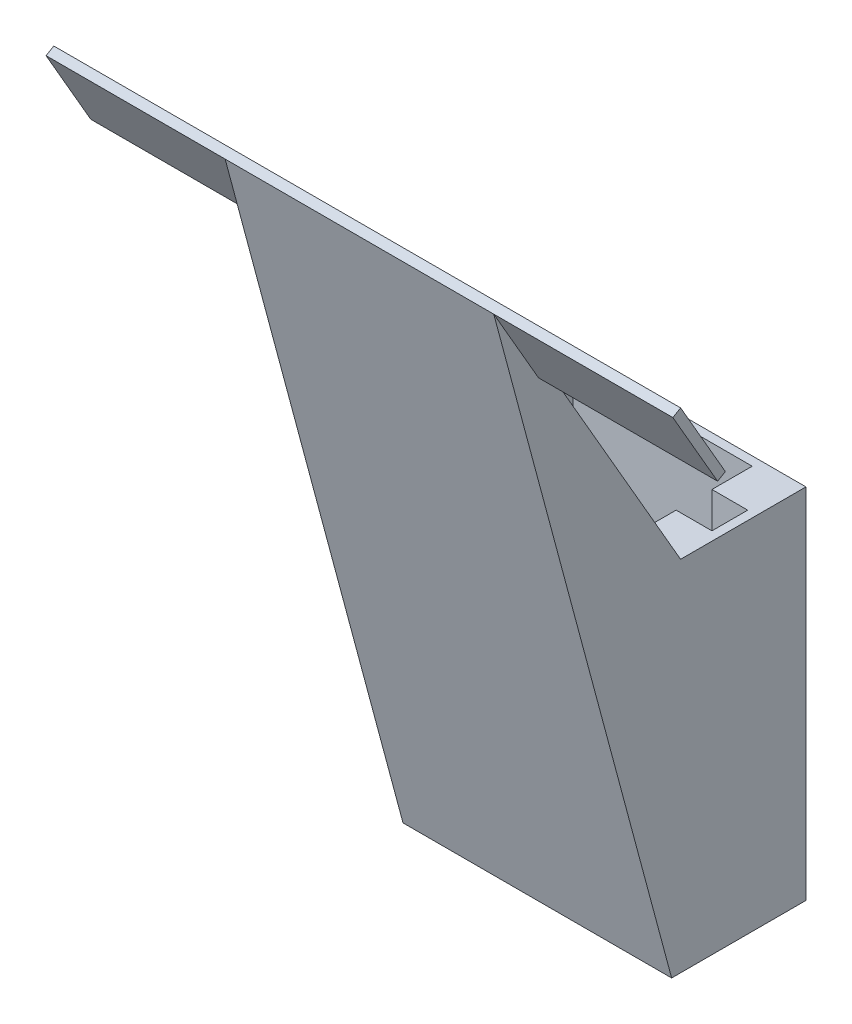
ISO-10303-21;
HEADER;
FILE_DESCRIPTION(('STEP AP214'),'2;1');
FILE_NAME('part.step','',(''),(''),'','','');
FILE_SCHEMA(('AUTOMOTIVE_DESIGN { 1 0 10303 214 1 1 1 1 }'));
ENDSEC;
DATA;
#1=APPLICATION_CONTEXT('core data for automotive mechanical design processes');
#2=APPLICATION_PROTOCOL_DEFINITION('international standard','automotive_design',2000,#1);
#3=PRODUCT_CONTEXT('',#1,'mechanical');
#4=PRODUCT('Part','Part','',(#3));
#5=PRODUCT_RELATED_PRODUCT_CATEGORY('part','',(#4));
#6=PRODUCT_DEFINITION_FORMATION('','',#4);
#7=PRODUCT_DEFINITION_CONTEXT('part definition',#1,'design');
#8=PRODUCT_DEFINITION('design','',#6,#7);
#9=PRODUCT_DEFINITION_SHAPE('','',#8);
#10=(LENGTH_UNIT() NAMED_UNIT(*) SI_UNIT(.MILLI.,.METRE.));
#11=(NAMED_UNIT(*) PLANE_ANGLE_UNIT() SI_UNIT($,.RADIAN.));
#12=(NAMED_UNIT(*) SI_UNIT($,.STERADIAN.) SOLID_ANGLE_UNIT());
#13=UNCERTAINTY_MEASURE_WITH_UNIT(LENGTH_MEASURE(1.E-05),#10,'distance_accuracy_value','');
#14=(GEOMETRIC_REPRESENTATION_CONTEXT(3) GLOBAL_UNCERTAINTY_ASSIGNED_CONTEXT((#13)) GLOBAL_UNIT_ASSIGNED_CONTEXT((#10,
#11,#12)) REPRESENTATION_CONTEXT('',''));
#15=CARTESIAN_POINT('',(0.,0.,0.));
#16=DIRECTION('',(0.,0.,1.));
#17=DIRECTION('',(1.,0.,0.));
#18=AXIS2_PLACEMENT_3D('',#15,#16,#17);
#19=CARTESIAN_POINT('',(-7.5,20.,3.75));
#20=DIRECTION('',(1.,0.,0.));
#21=DIRECTION('',(0.,0.,-1.));
#22=AXIS2_PLACEMENT_3D('',#19,#20,#21);
#23=PLANE('',#22);
#24=DIRECTION('',(0.,0.866025403784439,0.5));
#25=VECTOR('',#24,1.);
#26=CARTESIAN_POINT('',(-7.5,37.0705080756888,13.6830127018922));
#27=LINE('',#26,#25);
#28=CARTESIAN_POINT('',(-7.5,32.7403810567666,11.1830127018922));
#29=VERTEX_POINT('',#28);
#30=CARTESIAN_POINT('',(-7.5,37.0705080756888,13.6830127018922));
#31=VERTEX_POINT('',#30);
#32=EDGE_CURVE('E259',#29,#31,#27,.T.);
#33=ORIENTED_EDGE('',*,*,#32,.F.);
#34=DIRECTION('',(0.,-0.499999999999985,0.866025403784447));
#35=VECTOR('',#34,1.);
#36=CARTESIAN_POINT('',(-7.5,32.9903810567666,10.75));
#37=LINE('',#36,#35);
#38=CARTESIAN_POINT('',(-7.5,32.9903810567666,10.75));
#39=VERTEX_POINT('',#38);
#40=EDGE_CURVE('E79',#39,#29,#37,.T.);
#41=ORIENTED_EDGE('',*,*,#40,.F.);
#42=DIRECTION('',(0.,-0.866025403784438,-0.500000000000001));
#43=VECTOR('',#42,1.);
#44=CARTESIAN_POINT('',(-7.5,20.,3.25));
#45=LINE('',#44,#43);
#46=CARTESIAN_POINT('',(-7.5,20.,3.25));
#47=VERTEX_POINT('',#46);
#48=EDGE_CURVE('E444',#39,#47,#45,.T.);
#49=ORIENTED_EDGE('',*,*,#48,.T.);
#50=DIRECTION('',(0.,0.,1.));
#51=VECTOR('',#50,1.);
#52=CARTESIAN_POINT('',(-7.5,20.,3.75));
#53=LINE('',#52,#51);
#54=CARTESIAN_POINT('',(-7.5,20.,-3.75));
#55=VERTEX_POINT('',#54);
#56=EDGE_CURVE('E288',#55,#47,#53,.T.);
#57=ORIENTED_EDGE('',*,*,#56,.F.);
#58=DIRECTION('',(0.,-1.,0.));
#59=VECTOR('',#58,1.);
#60=CARTESIAN_POINT('',(-7.5,20.,-3.75));
#61=LINE('',#60,#59);
#62=CARTESIAN_POINT('',(-7.5,0.,-3.75));
#63=VERTEX_POINT('',#62);
#64=EDGE_CURVE('E58',#55,#63,#61,.T.);
#65=ORIENTED_EDGE('',*,*,#64,.T.);
#66=DIRECTION('',(0.,0.,1.));
#67=VECTOR('',#66,1.);
#68=CARTESIAN_POINT('',(-7.5,0.,3.75));
#69=LINE('',#68,#67);
#70=CARTESIAN_POINT('',(-7.5,0.,3.75));
#71=VERTEX_POINT('',#70);
#72=EDGE_CURVE('E305',#63,#71,#69,.T.);
#73=ORIENTED_EDGE('',*,*,#72,.T.);
#74=DIRECTION('',(0.,0.965925826289068,0.258819045102521));
#75=VECTOR('',#74,1.);
#76=CARTESIAN_POINT('',(-7.5,37.0705080756888,13.6830127018922));
#77=LINE('',#76,#75);
#78=EDGE_CURVE('E441',#71,#31,#77,.T.);
#79=ORIENTED_EDGE('',*,*,#78,.T.);
#80=EDGE_LOOP('',(#33,#41,#49,#57,#65,#73,#79));
#81=FACE_BOUND('',#80,.T.);
#82=ADVANCED_FACE('F48',(#81),#23,.F.);
#83=CARTESIAN_POINT('',(0.,20.,0.));
#84=DIRECTION('',(0.,1.,0.));
#85=DIRECTION('',(0.,0.,1.));
#86=AXIS2_PLACEMENT_3D('',#83,#84,#85);
#87=PLANE('',#86);
#88=DIRECTION('',(-1.,0.,0.));
#89=VECTOR('',#88,1.);
#90=CARTESIAN_POINT('',(7.5,20.,3.25));
#91=LINE('',#90,#89);
#92=CARTESIAN_POINT('',(7.5,20.,3.25));
#93=VERTEX_POINT('',#92);
#94=CARTESIAN_POINT('',(5.,20.,3.25));
#95=VERTEX_POINT('',#94);
#96=EDGE_CURVE('E324',#93,#95,#91,.T.);
#97=ORIENTED_EDGE('',*,*,#96,.F.);
#98=DIRECTION('',(0.,0.,-1.));
#99=VECTOR('',#98,1.);
#100=CARTESIAN_POINT('',(7.5,20.,3.75));
#101=LINE('',#100,#99);
#102=CARTESIAN_POINT('',(7.5,20.,-3.75));
#103=VERTEX_POINT('',#102);
#104=EDGE_CURVE('E293',#93,#103,#101,.T.);
#105=ORIENTED_EDGE('',*,*,#104,.T.);
#106=DIRECTION('',(-1.,0.,0.));
#107=VECTOR('',#106,1.);
#108=CARTESIAN_POINT('',(7.5,20.,-3.75));
#109=LINE('',#108,#107);
#110=EDGE_CURVE('E301',#103,#55,#109,.T.);
#111=ORIENTED_EDGE('',*,*,#110,.T.);
#112=ORIENTED_EDGE('',*,*,#56,.T.);
#113=CARTESIAN_POINT('',(-5.,20.,3.25));
#114=VERTEX_POINT('',#113);
#115=EDGE_CURVE('E423',#114,#47,#91,.T.);
#116=ORIENTED_EDGE('',*,*,#115,.F.);
#117=DIRECTION('',(0.,0.,1.));
#118=VECTOR('',#117,1.);
#119=CARTESIAN_POINT('',(-5.,20.,3.25));
#120=LINE('',#119,#118);
#121=CARTESIAN_POINT('',(-5.,20.,1.));
#122=VERTEX_POINT('',#121);
#123=EDGE_CURVE('E581',#122,#114,#120,.T.);
#124=ORIENTED_EDGE('',*,*,#123,.F.);
#125=DIRECTION('',(1.,0.,0.));
#126=VECTOR('',#125,1.);
#127=CARTESIAN_POINT('',(-5.,20.,1.));
#128=LINE('',#127,#126);
#129=CARTESIAN_POINT('',(-7.,20.,1.));
#130=VERTEX_POINT('',#129);
#131=EDGE_CURVE('E579',#130,#122,#128,.T.);
#132=ORIENTED_EDGE('',*,*,#131,.F.);
#133=DIRECTION('',(0.,0.,1.));
#134=VECTOR('',#133,1.);
#135=CARTESIAN_POINT('',(-7.,20.,1.));
#136=LINE('',#135,#134);
#137=CARTESIAN_POINT('',(-7.,20.,-1.));
#138=VERTEX_POINT('',#137);
#139=EDGE_CURVE('E351',#138,#130,#136,.T.);
#140=ORIENTED_EDGE('',*,*,#139,.F.);
#141=DIRECTION('',(-1.,0.,0.));
#142=VECTOR('',#141,1.);
#143=CARTESIAN_POINT('',(-5.,20.,-1.));
#144=LINE('',#143,#142);
#145=CARTESIAN_POINT('',(-5.,20.,-1.));
#146=VERTEX_POINT('',#145);
#147=EDGE_CURVE('E344',#146,#138,#144,.T.);
#148=ORIENTED_EDGE('',*,*,#147,.F.);
#149=DIRECTION('',(0.,0.,1.));
#150=VECTOR('',#149,1.);
#151=CARTESIAN_POINT('',(-5.,20.,-1.));
#152=LINE('',#151,#150);
#153=CARTESIAN_POINT('',(-5.,20.,-3.25));
#154=VERTEX_POINT('',#153);
#155=EDGE_CURVE('E340',#154,#146,#152,.T.);
#156=ORIENTED_EDGE('',*,*,#155,.F.);
#157=DIRECTION('',(-1.,0.,0.));
#158=VECTOR('',#157,1.);
#159=CARTESIAN_POINT('',(5.,20.,-3.25));
#160=LINE('',#159,#158);
#161=CARTESIAN_POINT('',(5.,20.,-3.25));
#162=VERTEX_POINT('',#161);
#163=EDGE_CURVE('E345',#162,#154,#160,.T.);
#164=ORIENTED_EDGE('',*,*,#163,.F.);
#165=DIRECTION('',(0.,0.,-1.));
#166=VECTOR('',#165,1.);
#167=CARTESIAN_POINT('',(5.,20.,-1.));
#168=LINE('',#167,#166);
#169=CARTESIAN_POINT('',(5.,20.,-1.));
#170=VERTEX_POINT('',#169);
#171=EDGE_CURVE('E325',#170,#162,#168,.T.);
#172=ORIENTED_EDGE('',*,*,#171,.F.);
#173=DIRECTION('',(-1.,0.,0.));
#174=VECTOR('',#173,1.);
#175=CARTESIAN_POINT('',(7.,20.,-1.));
#176=LINE('',#175,#174);
#177=CARTESIAN_POINT('',(7.,20.,-1.));
#178=VERTEX_POINT('',#177);
#179=EDGE_CURVE('E596',#178,#170,#176,.T.);
#180=ORIENTED_EDGE('',*,*,#179,.F.);
#181=DIRECTION('',(0.,0.,-1.));
#182=VECTOR('',#181,1.);
#183=CARTESIAN_POINT('',(7.,20.,0.999999999999999));
#184=LINE('',#183,#182);
#185=CARTESIAN_POINT('',(7.,20.,0.999999999999999));
#186=VERTEX_POINT('',#185);
#187=EDGE_CURVE('E593',#186,#178,#184,.T.);
#188=ORIENTED_EDGE('',*,*,#187,.F.);
#189=DIRECTION('',(1.,0.,0.));
#190=VECTOR('',#189,1.);
#191=CARTESIAN_POINT('',(7.,20.,0.999999999999999));
#192=LINE('',#191,#190);
#193=CARTESIAN_POINT('',(5.,20.,0.999999999999999));
#194=VERTEX_POINT('',#193);
#195=EDGE_CURVE('E590',#194,#186,#192,.T.);
#196=ORIENTED_EDGE('',*,*,#195,.F.);
#197=DIRECTION('',(0.,0.,-1.));
#198=VECTOR('',#197,1.);
#199=CARTESIAN_POINT('',(5.,20.,3.25));
#200=LINE('',#199,#198);
#201=EDGE_CURVE('E587',#95,#194,#200,.T.);
#202=ORIENTED_EDGE('',*,*,#201,.F.);
#203=EDGE_LOOP('',(#97,#105,#111,#112,#116,#124,#132,#140,#148,#156,#164,#172,#180,#188,#196,#202));
#204=FACE_BOUND('',#203,.T.);
#205=ADVANCED_FACE('F516',(#204),#87,.T.);
#206=CARTESIAN_POINT('',(0.,0.,0.));
#207=DIRECTION('',(0.,1.,0.));
#208=DIRECTION('',(0.,0.,1.));
#209=AXIS2_PLACEMENT_3D('',#206,#207,#208);
#210=PLANE('',#209);
#211=ORIENTED_EDGE('',*,*,#72,.F.);
#212=DIRECTION('',(-1.,0.,0.));
#213=VECTOR('',#212,1.);
#214=CARTESIAN_POINT('',(7.5,0.,-3.75));
#215=LINE('',#214,#213);
#216=CARTESIAN_POINT('',(7.5,0.,-3.75));
#217=VERTEX_POINT('',#216);
#218=EDGE_CURVE('E294',#217,#63,#215,.T.);
#219=ORIENTED_EDGE('',*,*,#218,.F.);
#220=DIRECTION('',(0.,0.,-1.));
#221=VECTOR('',#220,1.);
#222=CARTESIAN_POINT('',(7.5,0.,3.75));
#223=LINE('',#222,#221);
#224=CARTESIAN_POINT('',(7.5,0.,3.75));
#225=VERTEX_POINT('',#224);
#226=EDGE_CURVE('E383',#225,#217,#223,.T.);
#227=ORIENTED_EDGE('',*,*,#226,.F.);
#228=DIRECTION('',(1.,0.,0.));
#229=VECTOR('',#228,1.);
#230=CARTESIAN_POINT('',(7.5,0.,3.75));
#231=LINE('',#230,#229);
#232=EDGE_CURVE('E378',#71,#225,#231,.T.);
#233=ORIENTED_EDGE('',*,*,#232,.F.);
#234=EDGE_LOOP('',(#211,#219,#227,#233));
#235=FACE_BOUND('',#234,.T.);
#236=DIRECTION('',(-1.,0.,0.));
#237=VECTOR('',#236,1.);
#238=CARTESIAN_POINT('',(5.,0.,-3.25));
#239=LINE('',#238,#237);
#240=CARTESIAN_POINT('',(5.,0.,-3.25));
#241=VERTEX_POINT('',#240);
#242=CARTESIAN_POINT('',(-5.,0.,-3.25));
#243=VERTEX_POINT('',#242);
#244=EDGE_CURVE('E317',#241,#243,#239,.T.);
#245=ORIENTED_EDGE('',*,*,#244,.T.);
#246=DIRECTION('',(0.,0.,1.));
#247=VECTOR('',#246,1.);
#248=CARTESIAN_POINT('',(-5.,0.,-1.));
#249=LINE('',#248,#247);
#250=CARTESIAN_POINT('',(-5.,0.,-1.));
#251=VERTEX_POINT('',#250);
#252=EDGE_CURVE('E323',#243,#251,#249,.T.);
#253=ORIENTED_EDGE('',*,*,#252,.T.);
#254=DIRECTION('',(-1.,0.,0.));
#255=VECTOR('',#254,1.);
#256=CARTESIAN_POINT('',(-5.,0.,-1.));
#257=LINE('',#256,#255);
#258=CARTESIAN_POINT('',(-7.,0.,-1.));
#259=VERTEX_POINT('',#258);
#260=EDGE_CURVE('E332',#251,#259,#257,.T.);
#261=ORIENTED_EDGE('',*,*,#260,.T.);
#262=DIRECTION('',(0.,0.,1.));
#263=VECTOR('',#262,1.);
#264=CARTESIAN_POINT('',(-7.,0.,1.));
#265=LINE('',#264,#263);
#266=CARTESIAN_POINT('',(-7.,0.,1.));
#267=VERTEX_POINT('',#266);
#268=EDGE_CURVE('E542',#259,#267,#265,.T.);
#269=ORIENTED_EDGE('',*,*,#268,.T.);
#270=DIRECTION('',(1.,0.,0.));
#271=VECTOR('',#270,1.);
#272=CARTESIAN_POINT('',(-5.,0.,1.));
#273=LINE('',#272,#271);
#274=CARTESIAN_POINT('',(-5.,0.,1.));
#275=VERTEX_POINT('',#274);
#276=EDGE_CURVE('E545',#267,#275,#273,.T.);
#277=ORIENTED_EDGE('',*,*,#276,.T.);
#278=DIRECTION('',(0.,0.,1.));
#279=VECTOR('',#278,1.);
#280=CARTESIAN_POINT('',(-5.,0.,3.25));
#281=LINE('',#280,#279);
#282=CARTESIAN_POINT('',(-5.,0.,3.25));
#283=VERTEX_POINT('',#282);
#284=EDGE_CURVE('E548',#275,#283,#281,.T.);
#285=ORIENTED_EDGE('',*,*,#284,.T.);
#286=DIRECTION('',(1.,0.,0.));
#287=VECTOR('',#286,1.);
#288=CARTESIAN_POINT('',(5.,0.,3.25));
#289=LINE('',#288,#287);
#290=CARTESIAN_POINT('',(5.,0.,3.25));
#291=VERTEX_POINT('',#290);
#292=EDGE_CURVE('E552',#283,#291,#289,.T.);
#293=ORIENTED_EDGE('',*,*,#292,.T.);
#294=DIRECTION('',(0.,0.,-1.));
#295=VECTOR('',#294,1.);
#296=CARTESIAN_POINT('',(5.,0.,3.25));
#297=LINE('',#296,#295);
#298=CARTESIAN_POINT('',(5.,0.,0.999999999999999));
#299=VERTEX_POINT('',#298);
#300=EDGE_CURVE('E556',#291,#299,#297,.T.);
#301=ORIENTED_EDGE('',*,*,#300,.T.);
#302=DIRECTION('',(1.,0.,0.));
#303=VECTOR('',#302,1.);
#304=CARTESIAN_POINT('',(7.,0.,0.999999999999999));
#305=LINE('',#304,#303);
#306=CARTESIAN_POINT('',(7.,0.,0.999999999999999));
#307=VERTEX_POINT('',#306);
#308=EDGE_CURVE('E560',#299,#307,#305,.T.);
#309=ORIENTED_EDGE('',*,*,#308,.T.);
#310=DIRECTION('',(0.,0.,-1.));
#311=VECTOR('',#310,1.);
#312=CARTESIAN_POINT('',(7.,0.,0.999999999999999));
#313=LINE('',#312,#311);
#314=CARTESIAN_POINT('',(7.,0.,-1.));
#315=VERTEX_POINT('',#314);
#316=EDGE_CURVE('E564',#307,#315,#313,.T.);
#317=ORIENTED_EDGE('',*,*,#316,.T.);
#318=DIRECTION('',(-1.,0.,0.));
#319=VECTOR('',#318,1.);
#320=CARTESIAN_POINT('',(7.,0.,-1.));
#321=LINE('',#320,#319);
#322=CARTESIAN_POINT('',(5.,0.,-1.));
#323=VERTEX_POINT('',#322);
#324=EDGE_CURVE('E568',#315,#323,#321,.T.);
#325=ORIENTED_EDGE('',*,*,#324,.T.);
#326=DIRECTION('',(0.,0.,-1.));
#327=VECTOR('',#326,1.);
#328=CARTESIAN_POINT('',(5.,0.,-1.));
#329=LINE('',#328,#327);
#330=EDGE_CURVE('E572',#323,#241,#329,.T.);
#331=ORIENTED_EDGE('',*,*,#330,.T.);
#332=EDGE_LOOP('',(#245,#253,#261,#269,#277,#285,#293,#301,#309,#317,#325,#331));
#333=FACE_BOUND('',#332,.T.);
#334=ADVANCED_FACE('F531',(#235,#333),#210,.F.);
#335=CARTESIAN_POINT('',(7.5,20.,3.75));
#336=DIRECTION('',(-1.,0.,0.));
#337=DIRECTION('',(0.,0.,1.));
#338=AXIS2_PLACEMENT_3D('',#335,#336,#337);
#339=PLANE('',#338);
#340=DIRECTION('',(0.,-0.499999999999985,0.866025403784447));
#341=VECTOR('',#340,1.);
#342=CARTESIAN_POINT('',(7.5,32.9903810567666,10.75));
#343=LINE('',#342,#341);
#344=CARTESIAN_POINT('',(7.5,32.9903810567666,10.75));
#345=VERTEX_POINT('',#344);
#346=CARTESIAN_POINT('',(7.5,32.7403810567666,11.1830127018922));
#347=VERTEX_POINT('',#346);
#348=EDGE_CURVE('E271',#345,#347,#343,.T.);
#349=ORIENTED_EDGE('',*,*,#348,.T.);
#350=DIRECTION('',(0.,0.866025403784439,0.5));
#351=VECTOR('',#350,1.);
#352=CARTESIAN_POINT('',(7.5,37.0705080756888,13.6830127018922));
#353=LINE('',#352,#351);
#354=CARTESIAN_POINT('',(7.5,37.0705080756888,13.6830127018922));
#355=VERTEX_POINT('',#354);
#356=EDGE_CURVE('E68',#347,#355,#353,.T.);
#357=ORIENTED_EDGE('',*,*,#356,.T.);
#358=DIRECTION('',(0.,0.965925826289068,0.258819045102521));
#359=VECTOR('',#358,1.);
#360=CARTESIAN_POINT('',(7.5,37.0705080756888,13.6830127018922));
#361=LINE('',#360,#359);
#362=EDGE_CURVE('E438',#225,#355,#361,.T.);
#363=ORIENTED_EDGE('',*,*,#362,.F.);
#364=ORIENTED_EDGE('',*,*,#226,.T.);
#365=DIRECTION('',(0.,-1.,0.));
#366=VECTOR('',#365,1.);
#367=CARTESIAN_POINT('',(7.5,20.,-3.75));
#368=LINE('',#367,#366);
#369=EDGE_CURVE('E12',#103,#217,#368,.T.);
#370=ORIENTED_EDGE('',*,*,#369,.F.);
#371=ORIENTED_EDGE('',*,*,#104,.F.);
#372=DIRECTION('',(0.,-0.866025403784438,-0.500000000000001));
#373=VECTOR('',#372,1.);
#374=CARTESIAN_POINT('',(7.5,20.,3.25));
#375=LINE('',#374,#373);
#376=EDGE_CURVE('E419',#345,#93,#375,.T.);
#377=ORIENTED_EDGE('',*,*,#376,.F.);
#378=EDGE_LOOP('',(#349,#357,#363,#364,#370,#371,#377));
#379=FACE_BOUND('',#378,.T.);
#380=ADVANCED_FACE('F534',(#379),#339,.F.);
#381=CARTESIAN_POINT('',(7.5,20.,-3.75));
#382=DIRECTION('',(0.,0.,1.));
#383=DIRECTION('',(1.,0.,0.));
#384=AXIS2_PLACEMENT_3D('',#381,#382,#383);
#385=PLANE('',#384);
#386=ORIENTED_EDGE('',*,*,#218,.T.);
#387=ORIENTED_EDGE('',*,*,#64,.F.);
#388=ORIENTED_EDGE('',*,*,#110,.F.);
#389=ORIENTED_EDGE('',*,*,#369,.T.);
#390=EDGE_LOOP('',(#386,#387,#388,#389));
#391=FACE_BOUND('',#390,.T.);
#392=ADVANCED_FACE('F523',(#391),#385,.F.);
#393=CARTESIAN_POINT('',(5.,20.,-3.25));
#394=DIRECTION('',(0.,0.,1.));
#395=DIRECTION('',(1.,0.,0.));
#396=AXIS2_PLACEMENT_3D('',#393,#394,#395);
#397=PLANE('',#396);
#398=ORIENTED_EDGE('',*,*,#244,.F.);
#399=DIRECTION('',(0.,-1.,0.));
#400=VECTOR('',#399,1.);
#401=CARTESIAN_POINT('',(5.,20.,-3.25));
#402=LINE('',#401,#400);
#403=EDGE_CURVE('E601',#162,#241,#402,.T.);
#404=ORIENTED_EDGE('',*,*,#403,.F.);
#405=ORIENTED_EDGE('',*,*,#163,.T.);
#406=DIRECTION('',(0.,-1.,0.));
#407=VECTOR('',#406,1.);
#408=CARTESIAN_POINT('',(-5.,20.,-3.25));
#409=LINE('',#408,#407);
#410=EDGE_CURVE('E295',#154,#243,#409,.T.);
#411=ORIENTED_EDGE('',*,*,#410,.T.);
#412=EDGE_LOOP('',(#398,#404,#405,#411));
#413=FACE_BOUND('',#412,.T.);
#414=ADVANCED_FACE('F672',(#413),#397,.T.);
#415=CARTESIAN_POINT('',(-5.,20.,-1.));
#416=DIRECTION('',(1.,0.,0.));
#417=DIRECTION('',(0.,0.,-1.));
#418=AXIS2_PLACEMENT_3D('',#415,#416,#417);
#419=PLANE('',#418);
#420=ORIENTED_EDGE('',*,*,#252,.F.);
#421=ORIENTED_EDGE('',*,*,#410,.F.);
#422=ORIENTED_EDGE('',*,*,#155,.T.);
#423=DIRECTION('',(0.,-1.,0.));
#424=VECTOR('',#423,1.);
#425=CARTESIAN_POINT('',(-5.,20.,-1.));
#426=LINE('',#425,#424);
#427=EDGE_CURVE('E363',#146,#251,#426,.T.);
#428=ORIENTED_EDGE('',*,*,#427,.T.);
#429=EDGE_LOOP('',(#420,#421,#422,#428));
#430=FACE_BOUND('',#429,.T.);
#431=ADVANCED_FACE('F674',(#430),#419,.T.);
#432=CARTESIAN_POINT('',(-5.,20.,-1.));
#433=DIRECTION('',(0.,0.,1.));
#434=DIRECTION('',(1.,0.,0.));
#435=AXIS2_PLACEMENT_3D('',#432,#433,#434);
#436=PLANE('',#435);
#437=ORIENTED_EDGE('',*,*,#260,.F.);
#438=ORIENTED_EDGE('',*,*,#427,.F.);
#439=ORIENTED_EDGE('',*,*,#147,.T.);
#440=DIRECTION('',(0.,-1.,0.));
#441=VECTOR('',#440,1.);
#442=CARTESIAN_POINT('',(-7.,20.,-1.));
#443=LINE('',#442,#441);
#444=EDGE_CURVE('E359',#138,#259,#443,.T.);
#445=ORIENTED_EDGE('',*,*,#444,.T.);
#446=EDGE_LOOP('',(#437,#438,#439,#445));
#447=FACE_BOUND('',#446,.T.);
#448=ADVANCED_FACE('F638',(#447),#436,.T.);
#449=CARTESIAN_POINT('',(-7.,20.,1.));
#450=DIRECTION('',(1.,0.,0.));
#451=DIRECTION('',(0.,0.,-1.));
#452=AXIS2_PLACEMENT_3D('',#449,#450,#451);
#453=PLANE('',#452);
#454=ORIENTED_EDGE('',*,*,#268,.F.);
#455=ORIENTED_EDGE('',*,*,#444,.F.);
#456=ORIENTED_EDGE('',*,*,#139,.T.);
#457=DIRECTION('',(0.,-1.,0.));
#458=VECTOR('',#457,1.);
#459=CARTESIAN_POINT('',(-7.,20.,1.));
#460=LINE('',#459,#458);
#461=EDGE_CURVE('E364',#130,#267,#460,.T.);
#462=ORIENTED_EDGE('',*,*,#461,.T.);
#463=EDGE_LOOP('',(#454,#455,#456,#462));
#464=FACE_BOUND('',#463,.T.);
#465=ADVANCED_FACE('F629',(#464),#453,.T.);
#466=CARTESIAN_POINT('',(-5.,20.,1.));
#467=DIRECTION('',(0.,0.,-1.));
#468=DIRECTION('',(-1.,0.,0.));
#469=AXIS2_PLACEMENT_3D('',#466,#467,#468);
#470=PLANE('',#469);
#471=ORIENTED_EDGE('',*,*,#276,.F.);
#472=ORIENTED_EDGE('',*,*,#461,.F.);
#473=ORIENTED_EDGE('',*,*,#131,.T.);
#474=DIRECTION('',(0.,-1.,0.));
#475=VECTOR('',#474,1.);
#476=CARTESIAN_POINT('',(-5.,20.,1.));
#477=LINE('',#476,#475);
#478=EDGE_CURVE('E622',#122,#275,#477,.T.);
#479=ORIENTED_EDGE('',*,*,#478,.T.);
#480=EDGE_LOOP('',(#471,#472,#473,#479));
#481=FACE_BOUND('',#480,.T.);
#482=ADVANCED_FACE('F634',(#481),#470,.T.);
#483=CARTESIAN_POINT('',(-5.,20.,3.25));
#484=DIRECTION('',(1.,0.,0.));
#485=DIRECTION('',(0.,0.,-1.));
#486=AXIS2_PLACEMENT_3D('',#483,#484,#485);
#487=PLANE('',#486);
#488=ORIENTED_EDGE('',*,*,#284,.F.);
#489=ORIENTED_EDGE('',*,*,#478,.F.);
#490=ORIENTED_EDGE('',*,*,#123,.T.);
#491=DIRECTION('',(0.,-1.,0.));
#492=VECTOR('',#491,1.);
#493=CARTESIAN_POINT('',(-5.,20.,3.25));
#494=LINE('',#493,#492);
#495=EDGE_CURVE('E619',#114,#283,#494,.T.);
#496=ORIENTED_EDGE('',*,*,#495,.T.);
#497=EDGE_LOOP('',(#488,#489,#490,#496));
#498=FACE_BOUND('',#497,.T.);
#499=ADVANCED_FACE('F642',(#498),#487,.T.);
#500=CARTESIAN_POINT('',(5.,20.,3.25));
#501=DIRECTION('',(0.,0.,-1.));
#502=DIRECTION('',(-1.,0.,0.));
#503=AXIS2_PLACEMENT_3D('',#500,#501,#502);
#504=PLANE('',#503);
#505=ORIENTED_EDGE('',*,*,#292,.F.);
#506=ORIENTED_EDGE('',*,*,#495,.F.);
#507=DIRECTION('',(1.,0.,0.));
#508=VECTOR('',#507,1.);
#509=CARTESIAN_POINT('',(5.,20.,3.25));
#510=LINE('',#509,#508);
#511=EDGE_CURVE('E583',#114,#95,#510,.T.);
#512=ORIENTED_EDGE('',*,*,#511,.T.);
#513=DIRECTION('',(0.,-1.,0.));
#514=VECTOR('',#513,1.);
#515=CARTESIAN_POINT('',(5.,20.,3.25));
#516=LINE('',#515,#514);
#517=EDGE_CURVE('E616',#95,#291,#516,.T.);
#518=ORIENTED_EDGE('',*,*,#517,.T.);
#519=EDGE_LOOP('',(#505,#506,#512,#518));
#520=FACE_BOUND('',#519,.T.);
#521=ADVANCED_FACE('F647',(#520),#504,.T.);
#522=CARTESIAN_POINT('',(5.,20.,3.25));
#523=DIRECTION('',(-1.,0.,0.));
#524=DIRECTION('',(0.,0.,1.));
#525=AXIS2_PLACEMENT_3D('',#522,#523,#524);
#526=PLANE('',#525);
#527=ORIENTED_EDGE('',*,*,#300,.F.);
#528=ORIENTED_EDGE('',*,*,#517,.F.);
#529=ORIENTED_EDGE('',*,*,#201,.T.);
#530=DIRECTION('',(0.,-1.,0.));
#531=VECTOR('',#530,1.);
#532=CARTESIAN_POINT('',(5.,20.,0.999999999999999));
#533=LINE('',#532,#531);
#534=EDGE_CURVE('E613',#194,#299,#533,.T.);
#535=ORIENTED_EDGE('',*,*,#534,.T.);
#536=EDGE_LOOP('',(#527,#528,#529,#535));
#537=FACE_BOUND('',#536,.T.);
#538=ADVANCED_FACE('F651',(#537),#526,.T.);
#539=CARTESIAN_POINT('',(7.,20.,0.999999999999999));
#540=DIRECTION('',(0.,0.,-1.));
#541=DIRECTION('',(-1.,0.,0.));
#542=AXIS2_PLACEMENT_3D('',#539,#540,#541);
#543=PLANE('',#542);
#544=ORIENTED_EDGE('',*,*,#308,.F.);
#545=ORIENTED_EDGE('',*,*,#534,.F.);
#546=ORIENTED_EDGE('',*,*,#195,.T.);
#547=DIRECTION('',(0.,-1.,0.));
#548=VECTOR('',#547,1.);
#549=CARTESIAN_POINT('',(7.,20.,0.999999999999999));
#550=LINE('',#549,#548);
#551=EDGE_CURVE('E610',#186,#307,#550,.T.);
#552=ORIENTED_EDGE('',*,*,#551,.T.);
#553=EDGE_LOOP('',(#544,#545,#546,#552));
#554=FACE_BOUND('',#553,.T.);
#555=ADVANCED_FACE('F656',(#554),#543,.T.);
#556=CARTESIAN_POINT('',(7.,20.,0.999999999999999));
#557=DIRECTION('',(-1.,0.,0.));
#558=DIRECTION('',(0.,0.,1.));
#559=AXIS2_PLACEMENT_3D('',#556,#557,#558);
#560=PLANE('',#559);
#561=ORIENTED_EDGE('',*,*,#316,.F.);
#562=ORIENTED_EDGE('',*,*,#551,.F.);
#563=ORIENTED_EDGE('',*,*,#187,.T.);
#564=DIRECTION('',(0.,-1.,0.));
#565=VECTOR('',#564,1.);
#566=CARTESIAN_POINT('',(7.,20.,-1.));
#567=LINE('',#566,#565);
#568=EDGE_CURVE('E607',#178,#315,#567,.T.);
#569=ORIENTED_EDGE('',*,*,#568,.T.);
#570=EDGE_LOOP('',(#561,#562,#563,#569));
#571=FACE_BOUND('',#570,.T.);
#572=ADVANCED_FACE('F661',(#571),#560,.T.);
#573=CARTESIAN_POINT('',(7.,20.,-1.));
#574=DIRECTION('',(0.,0.,1.));
#575=DIRECTION('',(1.,0.,0.));
#576=AXIS2_PLACEMENT_3D('',#573,#574,#575);
#577=PLANE('',#576);
#578=ORIENTED_EDGE('',*,*,#324,.F.);
#579=ORIENTED_EDGE('',*,*,#568,.F.);
#580=ORIENTED_EDGE('',*,*,#179,.T.);
#581=DIRECTION('',(0.,-1.,0.));
#582=VECTOR('',#581,1.);
#583=CARTESIAN_POINT('',(5.,20.,-1.));
#584=LINE('',#583,#582);
#585=EDGE_CURVE('E604',#170,#323,#584,.T.);
#586=ORIENTED_EDGE('',*,*,#585,.T.);
#587=EDGE_LOOP('',(#578,#579,#580,#586));
#588=FACE_BOUND('',#587,.T.);
#589=ADVANCED_FACE('F666',(#588),#577,.T.);
#590=CARTESIAN_POINT('',(5.,20.,-1.));
#591=DIRECTION('',(-1.,0.,0.));
#592=DIRECTION('',(0.,0.,1.));
#593=AXIS2_PLACEMENT_3D('',#590,#591,#592);
#594=PLANE('',#593);
#595=ORIENTED_EDGE('',*,*,#330,.F.);
#596=ORIENTED_EDGE('',*,*,#585,.F.);
#597=ORIENTED_EDGE('',*,*,#171,.T.);
#598=ORIENTED_EDGE('',*,*,#403,.T.);
#599=EDGE_LOOP('',(#595,#596,#597,#598));
#600=FACE_BOUND('',#599,.T.);
#601=ADVANCED_FACE('F670',(#600),#594,.T.);
#602=CARTESIAN_POINT('',(7.5,20.,3.25));
#603=DIRECTION('',(0.,0.500000000000001,-0.866025403784438));
#604=DIRECTION('',(0.,0.866025403784438,0.500000000000001));
#605=AXIS2_PLACEMENT_3D('',#602,#603,#604);
#606=PLANE('',#605);
#607=ORIENTED_EDGE('',*,*,#48,.F.);
#608=DIRECTION('',(1.,0.,0.));
#609=VECTOR('',#608,1.);
#610=CARTESIAN_POINT('',(-17.5,32.9903810567666,10.75));
#611=LINE('',#610,#609);
#612=CARTESIAN_POINT('',(-17.5,32.9903810567666,10.75));
#613=VERTEX_POINT('',#612);
#614=EDGE_CURVE('E453',#613,#39,#611,.T.);
#615=ORIENTED_EDGE('',*,*,#614,.F.);
#616=DIRECTION('',(0.,-0.866025403784439,-0.5));
#617=VECTOR('',#616,1.);
#618=CARTESIAN_POINT('',(-17.5,32.9903810567666,10.75));
#619=LINE('',#618,#617);
#620=CARTESIAN_POINT('',(-17.5,37.3205080756888,13.25));
#621=VERTEX_POINT('',#620);
#622=EDGE_CURVE('E477',#621,#613,#619,.T.);
#623=ORIENTED_EDGE('',*,*,#622,.F.);
#624=DIRECTION('',(-1.,0.,0.));
#625=VECTOR('',#624,1.);
#626=CARTESIAN_POINT('',(7.5,37.3205080756888,13.25));
#627=LINE('',#626,#625);
#628=CARTESIAN_POINT('',(17.5,37.3205080756888,13.25));
#629=VERTEX_POINT('',#628);
#630=EDGE_CURVE('E418',#629,#621,#627,.T.);
#631=ORIENTED_EDGE('',*,*,#630,.F.);
#632=DIRECTION('',(0.,-0.866025403784439,-0.5));
#633=VECTOR('',#632,1.);
#634=CARTESIAN_POINT('',(17.5,32.9903810567666,10.75));
#635=LINE('',#634,#633);
#636=CARTESIAN_POINT('',(17.5,32.9903810567666,10.75));
#637=VERTEX_POINT('',#636);
#638=EDGE_CURVE('E275',#629,#637,#635,.T.);
#639=ORIENTED_EDGE('',*,*,#638,.T.);
#640=DIRECTION('',(-1.,0.,0.));
#641=VECTOR('',#640,1.);
#642=CARTESIAN_POINT('',(17.5,32.9903810567666,10.75));
#643=LINE('',#642,#641);
#644=EDGE_CURVE('E260',#637,#345,#643,.T.);
#645=ORIENTED_EDGE('',*,*,#644,.T.);
#646=ORIENTED_EDGE('',*,*,#376,.T.);
#647=ORIENTED_EDGE('',*,*,#96,.T.);
#648=ORIENTED_EDGE('',*,*,#511,.F.);
#649=ORIENTED_EDGE('',*,*,#115,.T.);
#650=EDGE_LOOP('',(#607,#615,#623,#631,#639,#645,#646,#647,#648,#649));
#651=FACE_BOUND('',#650,.T.);
#652=ADVANCED_FACE('F509',(#651),#606,.T.);
#653=CARTESIAN_POINT('',(7.5,37.3205080756888,13.25));
#654=DIRECTION('',(0.,0.866025403784439,0.5));
#655=DIRECTION('',(0.,-0.5,0.866025403784439));
#656=AXIS2_PLACEMENT_3D('',#653,#654,#655);
#657=PLANE('',#656);
#658=ORIENTED_EDGE('',*,*,#630,.T.);
#659=DIRECTION('',(0.,0.5,-0.866025403784439));
#660=VECTOR('',#659,1.);
#661=CARTESIAN_POINT('',(-17.5,37.3205080756888,13.25));
#662=LINE('',#661,#660);
#663=CARTESIAN_POINT('',(-17.5,37.0705080756888,13.6830127018922));
#664=VERTEX_POINT('',#663);
#665=EDGE_CURVE('E472',#664,#621,#662,.T.);
#666=ORIENTED_EDGE('',*,*,#665,.F.);
#667=DIRECTION('',(1.,0.,0.));
#668=VECTOR('',#667,1.);
#669=CARTESIAN_POINT('',(-17.5,37.0705080756888,13.6830127018922));
#670=LINE('',#669,#668);
#671=EDGE_CURVE('E445',#664,#31,#670,.T.);
#672=ORIENTED_EDGE('',*,*,#671,.T.);
#673=DIRECTION('',(-1.,0.,0.));
#674=VECTOR('',#673,1.);
#675=CARTESIAN_POINT('',(7.5,37.0705080756888,13.6830127018922));
#676=LINE('',#675,#674);
#677=EDGE_CURVE('E414',#355,#31,#676,.T.);
#678=ORIENTED_EDGE('',*,*,#677,.F.);
#679=DIRECTION('',(-1.,0.,0.));
#680=VECTOR('',#679,1.);
#681=CARTESIAN_POINT('',(17.5,37.0705080756888,13.6830127018922));
#682=LINE('',#681,#680);
#683=CARTESIAN_POINT('',(17.5,37.0705080756888,13.6830127018922));
#684=VERTEX_POINT('',#683);
#685=EDGE_CURVE('E404',#684,#355,#682,.T.);
#686=ORIENTED_EDGE('',*,*,#685,.F.);
#687=DIRECTION('',(0.,0.5,-0.866025403784439));
#688=VECTOR('',#687,1.);
#689=CARTESIAN_POINT('',(17.5,37.3205080756888,13.25));
#690=LINE('',#689,#688);
#691=EDGE_CURVE('E269',#684,#629,#690,.T.);
#692=ORIENTED_EDGE('',*,*,#691,.T.);
#693=EDGE_LOOP('',(#658,#666,#672,#678,#686,#692));
#694=FACE_BOUND('',#693,.T.);
#695=ADVANCED_FACE('F793',(#694),#657,.T.);
#696=CARTESIAN_POINT('',(7.5,37.0705080756888,13.6830127018922));
#697=DIRECTION('',(0.,-0.258819045102521,0.965925826289068));
#698=DIRECTION('',(0.,-0.965925826289068,-0.258819045102521));
#699=AXIS2_PLACEMENT_3D('',#696,#697,#698);
#700=PLANE('',#699);
#701=ORIENTED_EDGE('',*,*,#78,.F.);
#702=ORIENTED_EDGE('',*,*,#232,.T.);
#703=ORIENTED_EDGE('',*,*,#362,.T.);
#704=ORIENTED_EDGE('',*,*,#677,.T.);
#705=EDGE_LOOP('',(#701,#702,#703,#704));
#706=FACE_BOUND('',#705,.T.);
#707=ADVANCED_FACE('F797',(#706),#700,.T.);
#708=CARTESIAN_POINT('',(-17.5,37.0705080756888,13.6830127018922));
#709=DIRECTION('',(0.,0.5,-0.866025403784439));
#710=DIRECTION('',(0.,0.866025403784439,0.5));
#711=AXIS2_PLACEMENT_3D('',#708,#709,#710);
#712=PLANE('',#711);
#713=ORIENTED_EDGE('',*,*,#32,.T.);
#714=ORIENTED_EDGE('',*,*,#671,.F.);
#715=DIRECTION('',(0.,0.866025403784439,0.5));
#716=VECTOR('',#715,1.);
#717=CARTESIAN_POINT('',(-17.5,37.0705080756888,13.6830127018922));
#718=LINE('',#717,#716);
#719=CARTESIAN_POINT('',(-17.5,32.7403810567666,11.1830127018922));
#720=VERTEX_POINT('',#719);
#721=EDGE_CURVE('E467',#720,#664,#718,.T.);
#722=ORIENTED_EDGE('',*,*,#721,.F.);
#723=DIRECTION('',(1.,0.,0.));
#724=VECTOR('',#723,1.);
#725=CARTESIAN_POINT('',(-17.5,32.7403810567666,11.1830127018922));
#726=LINE('',#725,#724);
#727=EDGE_CURVE('E457',#720,#29,#726,.T.);
#728=ORIENTED_EDGE('',*,*,#727,.T.);
#729=EDGE_LOOP('',(#713,#714,#722,#728));
#730=FACE_BOUND('',#729,.T.);
#731=ADVANCED_FACE('F501',(#730),#712,.F.);
#732=CARTESIAN_POINT('',(-17.5,32.9903810567666,10.75));
#733=DIRECTION('',(0.,0.866025403784447,0.499999999999985));
#734=DIRECTION('',(0.,-0.499999999999985,0.866025403784447));
#735=AXIS2_PLACEMENT_3D('',#732,#733,#734);
#736=PLANE('',#735);
#737=ORIENTED_EDGE('',*,*,#40,.T.);
#738=ORIENTED_EDGE('',*,*,#727,.F.);
#739=DIRECTION('',(0.,-0.499999999999985,0.866025403784447));
#740=VECTOR('',#739,1.);
#741=CARTESIAN_POINT('',(-17.5,32.9903810567666,10.75));
#742=LINE('',#741,#740);
#743=EDGE_CURVE('E485',#613,#720,#742,.T.);
#744=ORIENTED_EDGE('',*,*,#743,.F.);
#745=ORIENTED_EDGE('',*,*,#614,.T.);
#746=EDGE_LOOP('',(#737,#738,#744,#745));
#747=FACE_BOUND('',#746,.T.);
#748=ADVANCED_FACE('F496',(#747),#736,.F.);
#749=CARTESIAN_POINT('',(-17.5,0.,0.));
#750=DIRECTION('',(-1.,0.,0.));
#751=DIRECTION('',(0.,0.,1.));
#752=AXIS2_PLACEMENT_3D('',#749,#750,#751);
#753=PLANE('',#752);
#754=ORIENTED_EDGE('',*,*,#721,.T.);
#755=ORIENTED_EDGE('',*,*,#665,.T.);
#756=ORIENTED_EDGE('',*,*,#622,.T.);
#757=ORIENTED_EDGE('',*,*,#743,.T.);
#758=EDGE_LOOP('',(#754,#755,#756,#757));
#759=FACE_BOUND('',#758,.T.);
#760=ADVANCED_FACE('F507',(#759),#753,.T.);
#761=CARTESIAN_POINT('',(17.5,37.0705080756888,13.6830127018922));
#762=DIRECTION('',(0.,-0.5,0.866025403784439));
#763=DIRECTION('',(0.,-0.866025403784439,-0.5));
#764=AXIS2_PLACEMENT_3D('',#761,#762,#763);
#765=PLANE('',#764);
#766=ORIENTED_EDGE('',*,*,#356,.F.);
#767=DIRECTION('',(-1.,0.,0.));
#768=VECTOR('',#767,1.);
#769=CARTESIAN_POINT('',(17.5,32.7403810567666,11.1830127018922));
#770=LINE('',#769,#768);
#771=CARTESIAN_POINT('',(17.5,32.7403810567666,11.1830127018922));
#772=VERTEX_POINT('',#771);
#773=EDGE_CURVE('E249',#772,#347,#770,.T.);
#774=ORIENTED_EDGE('',*,*,#773,.F.);
#775=DIRECTION('',(0.,0.866025403784439,0.5));
#776=VECTOR('',#775,1.);
#777=CARTESIAN_POINT('',(17.5,37.0705080756888,13.6830127018922));
#778=LINE('',#777,#776);
#779=EDGE_CURVE('E252',#772,#684,#778,.T.);
#780=ORIENTED_EDGE('',*,*,#779,.T.);
#781=ORIENTED_EDGE('',*,*,#685,.T.);
#782=EDGE_LOOP('',(#766,#774,#780,#781));
#783=FACE_BOUND('',#782,.T.);
#784=ADVANCED_FACE('F251',(#783),#765,.T.);
#785=CARTESIAN_POINT('',(17.5,32.9903810567666,10.75));
#786=DIRECTION('',(0.,-0.866025403784447,-0.499999999999985));
#787=DIRECTION('',(0.,0.499999999999985,-0.866025403784447));
#788=AXIS2_PLACEMENT_3D('',#785,#786,#787);
#789=PLANE('',#788);
#790=ORIENTED_EDGE('',*,*,#348,.F.);
#791=ORIENTED_EDGE('',*,*,#644,.F.);
#792=DIRECTION('',(0.,-0.499999999999985,0.866025403784447));
#793=VECTOR('',#792,1.);
#794=CARTESIAN_POINT('',(17.5,32.9903810567666,10.75));
#795=LINE('',#794,#793);
#796=EDGE_CURVE('E266',#637,#772,#795,.T.);
#797=ORIENTED_EDGE('',*,*,#796,.T.);
#798=ORIENTED_EDGE('',*,*,#773,.T.);
#799=EDGE_LOOP('',(#790,#791,#797,#798));
#800=FACE_BOUND('',#799,.T.);
#801=ADVANCED_FACE('F273',(#800),#789,.T.);
#802=CARTESIAN_POINT('',(17.5,0.,0.));
#803=DIRECTION('',(1.,0.,0.));
#804=DIRECTION('',(0.,0.,1.));
#805=AXIS2_PLACEMENT_3D('',#802,#803,#804);
#806=PLANE('',#805);
#807=ORIENTED_EDGE('',*,*,#779,.F.);
#808=ORIENTED_EDGE('',*,*,#796,.F.);
#809=ORIENTED_EDGE('',*,*,#638,.F.);
#810=ORIENTED_EDGE('',*,*,#691,.F.);
#811=EDGE_LOOP('',(#807,#808,#809,#810));
#812=FACE_BOUND('',#811,.T.);
#813=ADVANCED_FACE('F264',(#812),#806,.T.);
#814=CLOSED_SHELL('',(#82,#205,#334,#380,#392,#414,#431,#448,#465,#482,#499,#521,#538,#555,#572,
#589,#601,#652,#695,#707,#731,#748,#760,#784,#801,#813));
#815=MANIFOLD_SOLID_BREP('B2',#814);
#816=ADVANCED_BREP_SHAPE_REPRESENTATION('',(#18,#815),#14);
#817=SHAPE_DEFINITION_REPRESENTATION(#9,#816);
ENDSEC;
END-ISO-10303-21;
